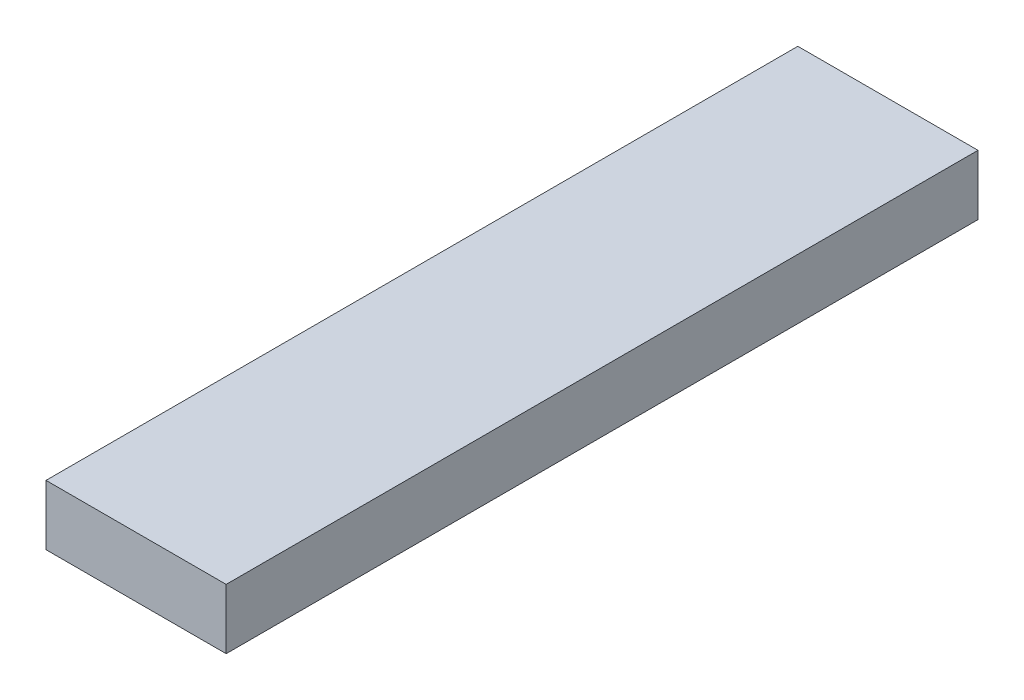
ISO-10303-21;
HEADER;
FILE_DESCRIPTION(('STEP AP214'),'2;1');
FILE_NAME('part.step','',(''),(''),'','','');
FILE_SCHEMA(('AUTOMOTIVE_DESIGN { 1 0 10303 214 1 1 1 1 }'));
ENDSEC;
DATA;
#1=APPLICATION_CONTEXT('core data for automotive mechanical design processes');
#2=APPLICATION_PROTOCOL_DEFINITION('international standard','automotive_design',2000,#1);
#3=PRODUCT_CONTEXT('',#1,'mechanical');
#4=PRODUCT('Part','Part','',(#3));
#5=PRODUCT_RELATED_PRODUCT_CATEGORY('part','',(#4));
#6=PRODUCT_DEFINITION_FORMATION('','',#4);
#7=PRODUCT_DEFINITION_CONTEXT('part definition',#1,'design');
#8=PRODUCT_DEFINITION('design','',#6,#7);
#9=PRODUCT_DEFINITION_SHAPE('','',#8);
#10=(LENGTH_UNIT() NAMED_UNIT(*) SI_UNIT(.MILLI.,.METRE.));
#11=(NAMED_UNIT(*) PLANE_ANGLE_UNIT() SI_UNIT($,.RADIAN.));
#12=(NAMED_UNIT(*) SI_UNIT($,.STERADIAN.) SOLID_ANGLE_UNIT());
#13=UNCERTAINTY_MEASURE_WITH_UNIT(LENGTH_MEASURE(1.E-05),#10,'distance_accuracy_value','');
#14=(GEOMETRIC_REPRESENTATION_CONTEXT(3) GLOBAL_UNCERTAINTY_ASSIGNED_CONTEXT((#13)) GLOBAL_UNIT_ASSIGNED_CONTEXT((#10,
#11,#12)) REPRESENTATION_CONTEXT('',''));
#15=CARTESIAN_POINT('',(0.,0.,0.));
#16=DIRECTION('',(0.,0.,1.));
#17=DIRECTION('',(1.,0.,0.));
#18=AXIS2_PLACEMENT_3D('',#15,#16,#17);
#19=CARTESIAN_POINT('',(0.,0.,159.));
#20=DIRECTION('',(1.,0.,0.));
#21=DIRECTION('',(0.,0.,-1.));
#22=AXIS2_PLACEMENT_3D('',#19,#20,#21);
#23=PLANE('',#22);
#24=DIRECTION('',(0.,-1.,0.));
#25=VECTOR('',#24,1.);
#26=CARTESIAN_POINT('',(0.,0.,0.));
#27=LINE('',#26,#25);
#28=CARTESIAN_POINT('',(0.,12.7,0.));
#29=VERTEX_POINT('',#28);
#30=CARTESIAN_POINT('',(0.,0.,0.));
#31=VERTEX_POINT('',#30);
#32=EDGE_CURVE('E107',#29,#31,#27,.T.);
#33=ORIENTED_EDGE('',*,*,#32,.T.);
#34=DIRECTION('',(0.,0.,-1.));
#35=VECTOR('',#34,1.);
#36=CARTESIAN_POINT('',(0.,0.,159.));
#37=LINE('',#36,#35);
#38=CARTESIAN_POINT('',(0.,0.,159.));
#39=VERTEX_POINT('',#38);
#40=EDGE_CURVE('E11',#39,#31,#37,.T.);
#41=ORIENTED_EDGE('',*,*,#40,.F.);
#42=DIRECTION('',(0.,-1.,0.));
#43=VECTOR('',#42,1.);
#44=CARTESIAN_POINT('',(0.,0.,159.));
#45=LINE('',#44,#43);
#46=CARTESIAN_POINT('',(0.,12.7,159.));
#47=VERTEX_POINT('',#46);
#48=EDGE_CURVE('E91',#47,#39,#45,.T.);
#49=ORIENTED_EDGE('',*,*,#48,.F.);
#50=DIRECTION('',(0.,0.,-1.));
#51=VECTOR('',#50,1.);
#52=CARTESIAN_POINT('',(0.,12.7,159.));
#53=LINE('',#52,#51);
#54=EDGE_CURVE('E103',#47,#29,#53,.T.);
#55=ORIENTED_EDGE('',*,*,#54,.T.);
#56=EDGE_LOOP('',(#33,#41,#49,#55));
#57=FACE_BOUND('',#56,.T.);
#58=ADVANCED_FACE('F39',(#57),#23,.F.);
#59=CARTESIAN_POINT('',(0.,0.,159.));
#60=DIRECTION('',(0.,1.,0.));
#61=DIRECTION('',(0.,0.,1.));
#62=AXIS2_PLACEMENT_3D('',#59,#60,#61);
#63=PLANE('',#62);
#64=DIRECTION('',(1.,0.,0.));
#65=VECTOR('',#64,1.);
#66=CARTESIAN_POINT('',(0.,0.,0.));
#67=LINE('',#66,#65);
#68=CARTESIAN_POINT('',(38.1,0.,0.));
#69=VERTEX_POINT('',#68);
#70=EDGE_CURVE('E96',#31,#69,#67,.T.);
#71=ORIENTED_EDGE('',*,*,#70,.T.);
#72=DIRECTION('',(0.,0.,-1.));
#73=VECTOR('',#72,1.);
#74=CARTESIAN_POINT('',(38.1,0.,159.));
#75=LINE('',#74,#73);
#76=CARTESIAN_POINT('',(38.1,0.,159.));
#77=VERTEX_POINT('',#76);
#78=EDGE_CURVE('E48',#77,#69,#75,.T.);
#79=ORIENTED_EDGE('',*,*,#78,.F.);
#80=DIRECTION('',(1.,0.,0.));
#81=VECTOR('',#80,1.);
#82=CARTESIAN_POINT('',(0.,0.,159.));
#83=LINE('',#82,#81);
#84=EDGE_CURVE('E86',#39,#77,#83,.T.);
#85=ORIENTED_EDGE('',*,*,#84,.F.);
#86=ORIENTED_EDGE('',*,*,#40,.T.);
#87=EDGE_LOOP('',(#71,#79,#85,#86));
#88=FACE_BOUND('',#87,.T.);
#89=ADVANCED_FACE('F95',(#88),#63,.F.);
#90=CARTESIAN_POINT('',(38.1,0.,159.));
#91=DIRECTION('',(-1.,0.,0.));
#92=DIRECTION('',(0.,0.,1.));
#93=AXIS2_PLACEMENT_3D('',#90,#91,#92);
#94=PLANE('',#93);
#95=DIRECTION('',(0.,1.,0.));
#96=VECTOR('',#95,1.);
#97=CARTESIAN_POINT('',(38.1,0.,0.));
#98=LINE('',#97,#96);
#99=CARTESIAN_POINT('',(38.1,12.7,0.));
#100=VERTEX_POINT('',#99);
#101=EDGE_CURVE('E73',#69,#100,#98,.T.);
#102=ORIENTED_EDGE('',*,*,#101,.T.);
#103=DIRECTION('',(0.,0.,-1.));
#104=VECTOR('',#103,1.);
#105=CARTESIAN_POINT('',(38.1,12.7,159.));
#106=LINE('',#105,#104);
#107=CARTESIAN_POINT('',(38.1,12.7,159.));
#108=VERTEX_POINT('',#107);
#109=EDGE_CURVE('E98',#108,#100,#106,.T.);
#110=ORIENTED_EDGE('',*,*,#109,.F.);
#111=DIRECTION('',(0.,1.,0.));
#112=VECTOR('',#111,1.);
#113=CARTESIAN_POINT('',(38.1,0.,159.));
#114=LINE('',#113,#112);
#115=EDGE_CURVE('E89',#77,#108,#114,.T.);
#116=ORIENTED_EDGE('',*,*,#115,.F.);
#117=ORIENTED_EDGE('',*,*,#78,.T.);
#118=EDGE_LOOP('',(#102,#110,#116,#117));
#119=FACE_BOUND('',#118,.T.);
#120=ADVANCED_FACE('F99',(#119),#94,.F.);
#121=CARTESIAN_POINT('',(0.,12.7,159.));
#122=DIRECTION('',(0.,-1.,0.));
#123=DIRECTION('',(0.,0.,-1.));
#124=AXIS2_PLACEMENT_3D('',#121,#122,#123);
#125=PLANE('',#124);
#126=DIRECTION('',(-1.,0.,0.));
#127=VECTOR('',#126,1.);
#128=CARTESIAN_POINT('',(0.,12.7,0.));
#129=LINE('',#128,#127);
#130=EDGE_CURVE('E79',#100,#29,#129,.T.);
#131=ORIENTED_EDGE('',*,*,#130,.T.);
#132=ORIENTED_EDGE('',*,*,#54,.F.);
#133=DIRECTION('',(-1.,0.,0.));
#134=VECTOR('',#133,1.);
#135=CARTESIAN_POINT('',(0.,12.7,159.));
#136=LINE('',#135,#134);
#137=EDGE_CURVE('E56',#108,#47,#136,.T.);
#138=ORIENTED_EDGE('',*,*,#137,.F.);
#139=ORIENTED_EDGE('',*,*,#109,.T.);
#140=EDGE_LOOP('',(#131,#132,#138,#139));
#141=FACE_BOUND('',#140,.T.);
#142=ADVANCED_FACE('F120',(#141),#125,.F.);
#143=CARTESIAN_POINT('',(0.,0.,159.));
#144=DIRECTION('',(0.,0.,-1.));
#145=DIRECTION('',(-1.,0.,0.));
#146=AXIS2_PLACEMENT_3D('',#143,#144,#145);
#147=PLANE('',#146);
#148=ORIENTED_EDGE('',*,*,#48,.T.);
#149=ORIENTED_EDGE('',*,*,#84,.T.);
#150=ORIENTED_EDGE('',*,*,#115,.T.);
#151=ORIENTED_EDGE('',*,*,#137,.T.);
#152=EDGE_LOOP('',(#148,#149,#150,#151));
#153=FACE_BOUND('',#152,.T.);
#154=ADVANCED_FACE('F87',(#153),#147,.F.);
#155=CARTESIAN_POINT('',(0.,0.,0.));
#156=DIRECTION('',(0.,0.,-1.));
#157=DIRECTION('',(-1.,0.,0.));
#158=AXIS2_PLACEMENT_3D('',#155,#156,#157);
#159=PLANE('',#158);
#160=ORIENTED_EDGE('',*,*,#32,.F.);
#161=ORIENTED_EDGE('',*,*,#130,.F.);
#162=ORIENTED_EDGE('',*,*,#101,.F.);
#163=ORIENTED_EDGE('',*,*,#70,.F.);
#164=EDGE_LOOP('',(#160,#161,#162,#163));
#165=FACE_BOUND('',#164,.T.);
#166=ADVANCED_FACE('F123',(#165),#159,.T.);
#167=CLOSED_SHELL('',(#58,#89,#120,#142,#154,#166));
#168=MANIFOLD_SOLID_BREP('B2',#167);
#169=ADVANCED_BREP_SHAPE_REPRESENTATION('',(#18,#168),#14);
#170=SHAPE_DEFINITION_REPRESENTATION(#9,#169);
ENDSEC;
END-ISO-10303-21;
